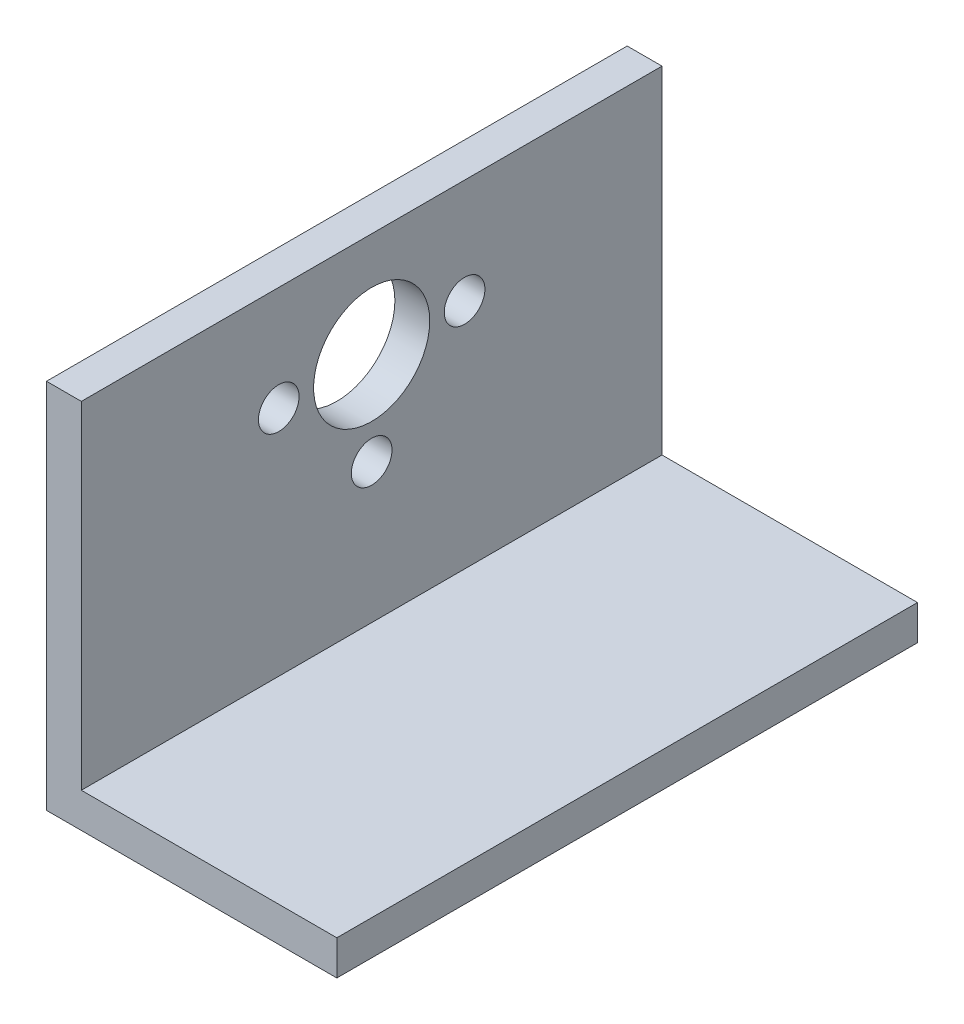
ISO-10303-21;
HEADER;
FILE_DESCRIPTION(('STEP AP214'),'2;1');
FILE_NAME('part.step','',(''),(''),'','','');
FILE_SCHEMA(('AUTOMOTIVE_DESIGN { 1 0 10303 214 1 1 1 1 }'));
ENDSEC;
DATA;
#1=APPLICATION_CONTEXT('core data for automotive mechanical design processes');
#2=APPLICATION_PROTOCOL_DEFINITION('international standard','automotive_design',2000,#1);
#3=PRODUCT_CONTEXT('',#1,'mechanical');
#4=PRODUCT('Part','Part','',(#3));
#5=PRODUCT_RELATED_PRODUCT_CATEGORY('part','',(#4));
#6=PRODUCT_DEFINITION_FORMATION('','',#4);
#7=PRODUCT_DEFINITION_CONTEXT('part definition',#1,'design');
#8=PRODUCT_DEFINITION('design','',#6,#7);
#9=PRODUCT_DEFINITION_SHAPE('','',#8);
#10=(LENGTH_UNIT() NAMED_UNIT(*) SI_UNIT(.MILLI.,.METRE.));
#11=(NAMED_UNIT(*) PLANE_ANGLE_UNIT() SI_UNIT($,.RADIAN.));
#12=(NAMED_UNIT(*) SI_UNIT($,.STERADIAN.) SOLID_ANGLE_UNIT());
#13=UNCERTAINTY_MEASURE_WITH_UNIT(LENGTH_MEASURE(1.E-05),#10,'distance_accuracy_value','');
#14=(GEOMETRIC_REPRESENTATION_CONTEXT(3) GLOBAL_UNCERTAINTY_ASSIGNED_CONTEXT((#13)) GLOBAL_UNIT_ASSIGNED_CONTEXT((#10,
#11,#12)) REPRESENTATION_CONTEXT('',''));
#15=CARTESIAN_POINT('',(0.,0.,0.));
#16=DIRECTION('',(0.,0.,1.));
#17=DIRECTION('',(1.,0.,0.));
#18=AXIS2_PLACEMENT_3D('',#15,#16,#17);
#19=CARTESIAN_POINT('',(-10.8974850351584,31.3475628083256,50.));
#20=DIRECTION('',(0.,-1.,0.));
#21=DIRECTION('',(0.,0.,-1.));
#22=AXIS2_PLACEMENT_3D('',#19,#20,#21);
#23=PLANE('',#22);
#24=DIRECTION('',(-1.,0.,0.));
#25=VECTOR('',#24,1.);
#26=CARTESIAN_POINT('',(-10.8974850351584,31.3475628083256,0.));
#27=LINE('',#26,#25);
#28=CARTESIAN_POINT('',(-7.89748503515838,31.3475628083256,0.));
#29=VERTEX_POINT('',#28);
#30=CARTESIAN_POINT('',(-10.8974850351584,31.3475628083256,0.));
#31=VERTEX_POINT('',#30);
#32=EDGE_CURVE('E117',#29,#31,#27,.T.);
#33=ORIENTED_EDGE('',*,*,#32,.T.);
#34=DIRECTION('',(0.,0.,-1.));
#35=VECTOR('',#34,1.);
#36=CARTESIAN_POINT('',(-10.8974850351584,31.3475628083256,50.));
#37=LINE('',#36,#35);
#38=CARTESIAN_POINT('',(-10.8974850351584,31.3475628083256,50.));
#39=VERTEX_POINT('',#38);
#40=EDGE_CURVE('E11',#39,#31,#37,.T.);
#41=ORIENTED_EDGE('',*,*,#40,.F.);
#42=DIRECTION('',(-1.,0.,0.));
#43=VECTOR('',#42,1.);
#44=CARTESIAN_POINT('',(-10.8974850351584,31.3475628083256,50.));
#45=LINE('',#44,#43);
#46=CARTESIAN_POINT('',(-7.89748503515838,31.3475628083256,50.));
#47=VERTEX_POINT('',#46);
#48=EDGE_CURVE('E128',#47,#39,#45,.T.);
#49=ORIENTED_EDGE('',*,*,#48,.F.);
#50=DIRECTION('',(0.,0.,-1.));
#51=VECTOR('',#50,1.);
#52=CARTESIAN_POINT('',(-7.89748503515838,31.3475628083256,50.));
#53=LINE('',#52,#51);
#54=EDGE_CURVE('E113',#47,#29,#53,.T.);
#55=ORIENTED_EDGE('',*,*,#54,.T.);
#56=EDGE_LOOP('',(#33,#41,#49,#55));
#57=FACE_BOUND('',#56,.T.);
#58=ADVANCED_FACE('F33',(#57),#23,.F.);
#59=CARTESIAN_POINT('',(-10.8974850351584,-0.652437191674368,50.));
#60=DIRECTION('',(1.,0.,0.));
#61=DIRECTION('',(0.,0.,-1.));
#62=AXIS2_PLACEMENT_3D('',#59,#60,#61);
#63=PLANE('',#62);
#64=CARTESIAN_POINT('',(-10.8974850351584,22.3475628083256,17.));
#65=DIRECTION('',(1.,0.,0.));
#66=DIRECTION('',(0.,0.,-1.));
#67=AXIS2_PLACEMENT_3D('',#64,#65,#66);
#68=CIRCLE('',#67,1.75);
#69=CARTESIAN_POINT('',(-10.8974850351584,22.3475628083256,15.25));
#70=VERTEX_POINT('',#69);
#71=EDGE_CURVE('E245',#70,#70,#68,.T.);
#72=ORIENTED_EDGE('',*,*,#71,.T.);
#73=EDGE_LOOP('',(#72));
#74=FACE_BOUND('',#73,.T.);
#75=CARTESIAN_POINT('',(-10.8974850351584,22.3475628083256,33.));
#76=DIRECTION('',(1.,0.,0.));
#77=DIRECTION('',(0.,0.,-1.));
#78=AXIS2_PLACEMENT_3D('',#75,#76,#77);
#79=CIRCLE('',#78,1.75);
#80=CARTESIAN_POINT('',(-10.8974850351584,22.3475628083256,31.25));
#81=VERTEX_POINT('',#80);
#82=EDGE_CURVE('E254',#81,#81,#79,.T.);
#83=ORIENTED_EDGE('',*,*,#82,.T.);
#84=EDGE_LOOP('',(#83));
#85=FACE_BOUND('',#84,.T.);
#86=CARTESIAN_POINT('',(-10.8974850351584,14.3475628083256,25.));
#87=DIRECTION('',(1.,0.,0.));
#88=DIRECTION('',(0.,0.,-1.));
#89=AXIS2_PLACEMENT_3D('',#86,#87,#88);
#90=CIRCLE('',#89,1.75);
#91=CARTESIAN_POINT('',(-10.8974850351584,14.3475628083256,23.25));
#92=VERTEX_POINT('',#91);
#93=EDGE_CURVE('E260',#92,#92,#90,.T.);
#94=ORIENTED_EDGE('',*,*,#93,.T.);
#95=EDGE_LOOP('',(#94));
#96=FACE_BOUND('',#95,.T.);
#97=CARTESIAN_POINT('',(-10.8974850351584,22.3475628083256,25.));
#98=DIRECTION('',(1.,0.,0.));
#99=DIRECTION('',(0.,0.,-1.));
#100=AXIS2_PLACEMENT_3D('',#97,#98,#99);
#101=CIRCLE('',#100,5.);
#102=CARTESIAN_POINT('',(-10.8974850351584,22.3475628083256,20.));
#103=VERTEX_POINT('',#102);
#104=EDGE_CURVE('E121',#103,#103,#101,.T.);
#105=ORIENTED_EDGE('',*,*,#104,.T.);
#106=EDGE_LOOP('',(#105));
#107=FACE_BOUND('',#106,.T.);
#108=DIRECTION('',(0.,-1.,0.));
#109=VECTOR('',#108,1.);
#110=CARTESIAN_POINT('',(-10.8974850351584,-0.652437191674368,0.));
#111=LINE('',#110,#109);
#112=CARTESIAN_POINT('',(-10.8974850351584,-0.652437191674368,0.));
#113=VERTEX_POINT('',#112);
#114=EDGE_CURVE('E120',#31,#113,#111,.T.);
#115=ORIENTED_EDGE('',*,*,#114,.T.);
#116=DIRECTION('',(0.,0.,-1.));
#117=VECTOR('',#116,1.);
#118=CARTESIAN_POINT('',(-10.8974850351584,-0.652437191674368,50.));
#119=LINE('',#118,#117);
#120=CARTESIAN_POINT('',(-10.8974850351584,-0.652437191674368,50.));
#121=VERTEX_POINT('',#120);
#122=EDGE_CURVE('E41',#121,#113,#119,.T.);
#123=ORIENTED_EDGE('',*,*,#122,.F.);
#124=DIRECTION('',(0.,-1.,0.));
#125=VECTOR('',#124,1.);
#126=CARTESIAN_POINT('',(-10.8974850351584,-0.652437191674368,50.));
#127=LINE('',#126,#125);
#128=EDGE_CURVE('E86',#39,#121,#127,.T.);
#129=ORIENTED_EDGE('',*,*,#128,.F.);
#130=ORIENTED_EDGE('',*,*,#40,.T.);
#131=EDGE_LOOP('',(#115,#123,#129,#130));
#132=FACE_BOUND('',#131,.T.);
#133=ADVANCED_FACE('F155',(#74,#85,#96,#107,#132),#63,.F.);
#134=CARTESIAN_POINT('',(14.1025149648416,-0.652437191674365,50.));
#135=DIRECTION('',(0.,1.,0.));
#136=DIRECTION('',(-1.,0.,0.));
#137=AXIS2_PLACEMENT_3D('',#134,#135,#136);
#138=PLANE('',#137);
#139=DIRECTION('',(1.,0.,0.));
#140=VECTOR('',#139,1.);
#141=CARTESIAN_POINT('',(14.1025149648416,-0.652437191674365,0.));
#142=LINE('',#141,#140);
#143=CARTESIAN_POINT('',(14.1025149648416,-0.652437191674365,0.));
#144=VERTEX_POINT('',#143);
#145=EDGE_CURVE('E123',#113,#144,#142,.T.);
#146=ORIENTED_EDGE('',*,*,#145,.T.);
#147=DIRECTION('',(0.,0.,-1.));
#148=VECTOR('',#147,1.);
#149=CARTESIAN_POINT('',(14.1025149648416,-0.652437191674365,50.));
#150=LINE('',#149,#148);
#151=CARTESIAN_POINT('',(14.1025149648416,-0.652437191674365,50.));
#152=VERTEX_POINT('',#151);
#153=EDGE_CURVE('E108',#152,#144,#150,.T.);
#154=ORIENTED_EDGE('',*,*,#153,.F.);
#155=DIRECTION('',(1.,0.,0.));
#156=VECTOR('',#155,1.);
#157=CARTESIAN_POINT('',(14.1025149648416,-0.652437191674365,50.));
#158=LINE('',#157,#156);
#159=EDGE_CURVE('E99',#121,#152,#158,.T.);
#160=ORIENTED_EDGE('',*,*,#159,.F.);
#161=ORIENTED_EDGE('',*,*,#122,.T.);
#162=EDGE_LOOP('',(#146,#154,#160,#161));
#163=FACE_BOUND('',#162,.T.);
#164=ADVANCED_FACE('F134',(#163),#138,.F.);
#165=CARTESIAN_POINT('',(14.1025149648416,2.34756280832563,50.));
#166=DIRECTION('',(-1.,0.,0.));
#167=DIRECTION('',(0.,-1.,0.));
#168=AXIS2_PLACEMENT_3D('',#165,#166,#167);
#169=PLANE('',#168);
#170=DIRECTION('',(0.,1.,0.));
#171=VECTOR('',#170,1.);
#172=CARTESIAN_POINT('',(14.1025149648416,2.34756280832563,0.));
#173=LINE('',#172,#171);
#174=CARTESIAN_POINT('',(14.1025149648416,2.34756280832563,0.));
#175=VERTEX_POINT('',#174);
#176=EDGE_CURVE('E107',#144,#175,#173,.T.);
#177=ORIENTED_EDGE('',*,*,#176,.T.);
#178=DIRECTION('',(0.,0.,-1.));
#179=VECTOR('',#178,1.);
#180=CARTESIAN_POINT('',(14.1025149648416,2.34756280832563,50.));
#181=LINE('',#180,#179);
#182=CARTESIAN_POINT('',(14.1025149648416,2.34756280832563,50.));
#183=VERTEX_POINT('',#182);
#184=EDGE_CURVE('E104',#183,#175,#181,.T.);
#185=ORIENTED_EDGE('',*,*,#184,.F.);
#186=DIRECTION('',(0.,1.,0.));
#187=VECTOR('',#186,1.);
#188=CARTESIAN_POINT('',(14.1025149648416,2.34756280832563,50.));
#189=LINE('',#188,#187);
#190=EDGE_CURVE('E93',#152,#183,#189,.T.);
#191=ORIENTED_EDGE('',*,*,#190,.F.);
#192=ORIENTED_EDGE('',*,*,#153,.T.);
#193=EDGE_LOOP('',(#177,#185,#191,#192));
#194=FACE_BOUND('',#193,.T.);
#195=ADVANCED_FACE('F105',(#194),#169,.F.);
#196=CARTESIAN_POINT('',(-7.89748503515838,2.34756280832563,50.));
#197=DIRECTION('',(0.,-1.,0.));
#198=DIRECTION('',(1.,0.,0.));
#199=AXIS2_PLACEMENT_3D('',#196,#197,#198);
#200=PLANE('',#199);
#201=DIRECTION('',(-1.,0.,0.));
#202=VECTOR('',#201,1.);
#203=CARTESIAN_POINT('',(-7.89748503515838,2.34756280832563,0.));
#204=LINE('',#203,#202);
#205=CARTESIAN_POINT('',(-7.89748503515838,2.34756280832563,0.));
#206=VERTEX_POINT('',#205);
#207=EDGE_CURVE('E72',#175,#206,#204,.T.);
#208=ORIENTED_EDGE('',*,*,#207,.T.);
#209=DIRECTION('',(0.,0.,-1.));
#210=VECTOR('',#209,1.);
#211=CARTESIAN_POINT('',(-7.89748503515838,2.34756280832563,50.));
#212=LINE('',#211,#210);
#213=CARTESIAN_POINT('',(-7.89748503515838,2.34756280832563,50.));
#214=VERTEX_POINT('',#213);
#215=EDGE_CURVE('E109',#214,#206,#212,.T.);
#216=ORIENTED_EDGE('',*,*,#215,.F.);
#217=DIRECTION('',(-1.,0.,0.));
#218=VECTOR('',#217,1.);
#219=CARTESIAN_POINT('',(-7.89748503515838,2.34756280832563,50.));
#220=LINE('',#219,#218);
#221=EDGE_CURVE('E97',#183,#214,#220,.T.);
#222=ORIENTED_EDGE('',*,*,#221,.F.);
#223=ORIENTED_EDGE('',*,*,#184,.T.);
#224=EDGE_LOOP('',(#208,#216,#222,#223));
#225=FACE_BOUND('',#224,.T.);
#226=ADVANCED_FACE('F111',(#225),#200,.F.);
#227=CARTESIAN_POINT('',(-7.89748503515838,31.3475628083256,50.));
#228=DIRECTION('',(-1.,0.,0.));
#229=DIRECTION('',(0.,0.,1.));
#230=AXIS2_PLACEMENT_3D('',#227,#228,#229);
#231=PLANE('',#230);
#232=CARTESIAN_POINT('',(-7.89748503515838,22.3475628083256,17.));
#233=DIRECTION('',(1.,0.,0.));
#234=DIRECTION('',(0.,0.,-1.));
#235=AXIS2_PLACEMENT_3D('',#232,#233,#234);
#236=CIRCLE('',#235,1.75);
#237=CARTESIAN_POINT('',(-7.89748503515838,22.3475628083256,15.25));
#238=VERTEX_POINT('',#237);
#239=EDGE_CURVE('E247',#238,#238,#236,.T.);
#240=ORIENTED_EDGE('',*,*,#239,.F.);
#241=EDGE_LOOP('',(#240));
#242=FACE_BOUND('',#241,.T.);
#243=CARTESIAN_POINT('',(-7.89748503515838,22.3475628083256,33.));
#244=DIRECTION('',(1.,0.,0.));
#245=DIRECTION('',(0.,0.,-1.));
#246=AXIS2_PLACEMENT_3D('',#243,#244,#245);
#247=CIRCLE('',#246,1.75);
#248=CARTESIAN_POINT('',(-7.89748503515838,22.3475628083256,31.25));
#249=VERTEX_POINT('',#248);
#250=EDGE_CURVE('E249',#249,#249,#247,.T.);
#251=ORIENTED_EDGE('',*,*,#250,.F.);
#252=EDGE_LOOP('',(#251));
#253=FACE_BOUND('',#252,.T.);
#254=CARTESIAN_POINT('',(-7.89748503515838,14.3475628083256,25.));
#255=DIRECTION('',(1.,0.,0.));
#256=DIRECTION('',(0.,0.,-1.));
#257=AXIS2_PLACEMENT_3D('',#254,#255,#256);
#258=CIRCLE('',#257,1.75);
#259=CARTESIAN_POINT('',(-7.89748503515838,14.3475628083256,23.25));
#260=VERTEX_POINT('',#259);
#261=EDGE_CURVE('E257',#260,#260,#258,.T.);
#262=ORIENTED_EDGE('',*,*,#261,.F.);
#263=EDGE_LOOP('',(#262));
#264=FACE_BOUND('',#263,.T.);
#265=CARTESIAN_POINT('',(-7.89748503515838,22.3475628083256,25.));
#266=DIRECTION('',(1.,0.,0.));
#267=DIRECTION('',(0.,0.,-1.));
#268=AXIS2_PLACEMENT_3D('',#265,#266,#267);
#269=CIRCLE('',#268,5.);
#270=CARTESIAN_POINT('',(-7.89748503515838,22.3475628083256,20.));
#271=VERTEX_POINT('',#270);
#272=EDGE_CURVE('E263',#271,#271,#269,.T.);
#273=ORIENTED_EDGE('',*,*,#272,.F.);
#274=EDGE_LOOP('',(#273));
#275=FACE_BOUND('',#274,.T.);
#276=DIRECTION('',(0.,1.,0.));
#277=VECTOR('',#276,1.);
#278=CARTESIAN_POINT('',(-7.89748503515838,31.3475628083256,0.));
#279=LINE('',#278,#277);
#280=EDGE_CURVE('E78',#206,#29,#279,.T.);
#281=ORIENTED_EDGE('',*,*,#280,.T.);
#282=ORIENTED_EDGE('',*,*,#54,.F.);
#283=DIRECTION('',(0.,1.,0.));
#284=VECTOR('',#283,1.);
#285=CARTESIAN_POINT('',(-7.89748503515838,31.3475628083256,50.));
#286=LINE('',#285,#284);
#287=EDGE_CURVE('E49',#214,#47,#286,.T.);
#288=ORIENTED_EDGE('',*,*,#287,.F.);
#289=ORIENTED_EDGE('',*,*,#215,.T.);
#290=EDGE_LOOP('',(#281,#282,#288,#289));
#291=FACE_BOUND('',#290,.T.);
#292=ADVANCED_FACE('F141',(#242,#253,#264,#275,#291),#231,.F.);
#293=CARTESIAN_POINT('',(0.,0.,50.));
#294=DIRECTION('',(0.,0.,-1.));
#295=DIRECTION('',(-1.,0.,0.));
#296=AXIS2_PLACEMENT_3D('',#293,#294,#295);
#297=PLANE('',#296);
#298=ORIENTED_EDGE('',*,*,#48,.T.);
#299=ORIENTED_EDGE('',*,*,#128,.T.);
#300=ORIENTED_EDGE('',*,*,#159,.T.);
#301=ORIENTED_EDGE('',*,*,#190,.T.);
#302=ORIENTED_EDGE('',*,*,#221,.T.);
#303=ORIENTED_EDGE('',*,*,#287,.T.);
#304=EDGE_LOOP('',(#298,#299,#300,#301,#302,#303));
#305=FACE_BOUND('',#304,.T.);
#306=ADVANCED_FACE('F95',(#305),#297,.F.);
#307=CARTESIAN_POINT('',(0.,0.,0.));
#308=DIRECTION('',(0.,0.,-1.));
#309=DIRECTION('',(-1.,0.,0.));
#310=AXIS2_PLACEMENT_3D('',#307,#308,#309);
#311=PLANE('',#310);
#312=ORIENTED_EDGE('',*,*,#32,.F.);
#313=ORIENTED_EDGE('',*,*,#280,.F.);
#314=ORIENTED_EDGE('',*,*,#207,.F.);
#315=ORIENTED_EDGE('',*,*,#176,.F.);
#316=ORIENTED_EDGE('',*,*,#145,.F.);
#317=ORIENTED_EDGE('',*,*,#114,.F.);
#318=EDGE_LOOP('',(#312,#313,#314,#315,#316,#317));
#319=FACE_BOUND('',#318,.T.);
#320=ADVANCED_FACE('F137',(#319),#311,.T.);
#321=CARTESIAN_POINT('',(-7.89748503515838,22.3475628083256,25.));
#322=DIRECTION('',(1.,0.,0.));
#323=DIRECTION('',(0.,0.,-1.));
#324=AXIS2_PLACEMENT_3D('',#321,#322,#323);
#325=CYLINDRICAL_SURFACE('',#324,5.);
#326=ORIENTED_EDGE('',*,*,#104,.F.);
#327=EDGE_LOOP('',(#326));
#328=FACE_BOUND('',#327,.T.);
#329=ORIENTED_EDGE('',*,*,#272,.T.);
#330=EDGE_LOOP('',(#329));
#331=FACE_BOUND('',#330,.T.);
#332=ADVANCED_FACE('F192',(#328,#331),#325,.F.);
#333=CARTESIAN_POINT('',(-7.89748503515838,14.3475628083256,25.));
#334=DIRECTION('',(1.,0.,0.));
#335=DIRECTION('',(0.,0.,-1.));
#336=AXIS2_PLACEMENT_3D('',#333,#334,#335);
#337=CYLINDRICAL_SURFACE('',#336,1.75);
#338=ORIENTED_EDGE('',*,*,#93,.F.);
#339=EDGE_LOOP('',(#338));
#340=FACE_BOUND('',#339,.T.);
#341=ORIENTED_EDGE('',*,*,#261,.T.);
#342=EDGE_LOOP('',(#341));
#343=FACE_BOUND('',#342,.T.);
#344=ADVANCED_FACE('F199',(#340,#343),#337,.F.);
#345=CARTESIAN_POINT('',(-7.89748503515838,22.3475628083256,33.));
#346=DIRECTION('',(1.,0.,0.));
#347=DIRECTION('',(0.,0.,-1.));
#348=AXIS2_PLACEMENT_3D('',#345,#346,#347);
#349=CYLINDRICAL_SURFACE('',#348,1.75);
#350=ORIENTED_EDGE('',*,*,#82,.F.);
#351=EDGE_LOOP('',(#350));
#352=FACE_BOUND('',#351,.T.);
#353=ORIENTED_EDGE('',*,*,#250,.T.);
#354=EDGE_LOOP('',(#353));
#355=FACE_BOUND('',#354,.T.);
#356=ADVANCED_FACE('F219',(#352,#355),#349,.F.);
#357=CARTESIAN_POINT('',(-7.89748503515838,22.3475628083256,17.));
#358=DIRECTION('',(1.,0.,0.));
#359=DIRECTION('',(0.,0.,-1.));
#360=AXIS2_PLACEMENT_3D('',#357,#358,#359);
#361=CYLINDRICAL_SURFACE('',#360,1.75);
#362=ORIENTED_EDGE('',*,*,#71,.F.);
#363=EDGE_LOOP('',(#362));
#364=FACE_BOUND('',#363,.T.);
#365=ORIENTED_EDGE('',*,*,#239,.T.);
#366=EDGE_LOOP('',(#365));
#367=FACE_BOUND('',#366,.T.);
#368=ADVANCED_FACE('F229',(#364,#367),#361,.F.);
#369=CLOSED_SHELL('',(#58,#133,#164,#195,#226,#292,#306,#320,#332,#344,#356,#368));
#370=MANIFOLD_SOLID_BREP('B2',#369);
#371=ADVANCED_BREP_SHAPE_REPRESENTATION('',(#18,#370),#14);
#372=SHAPE_DEFINITION_REPRESENTATION(#9,#371);
ENDSEC;
END-ISO-10303-21;
